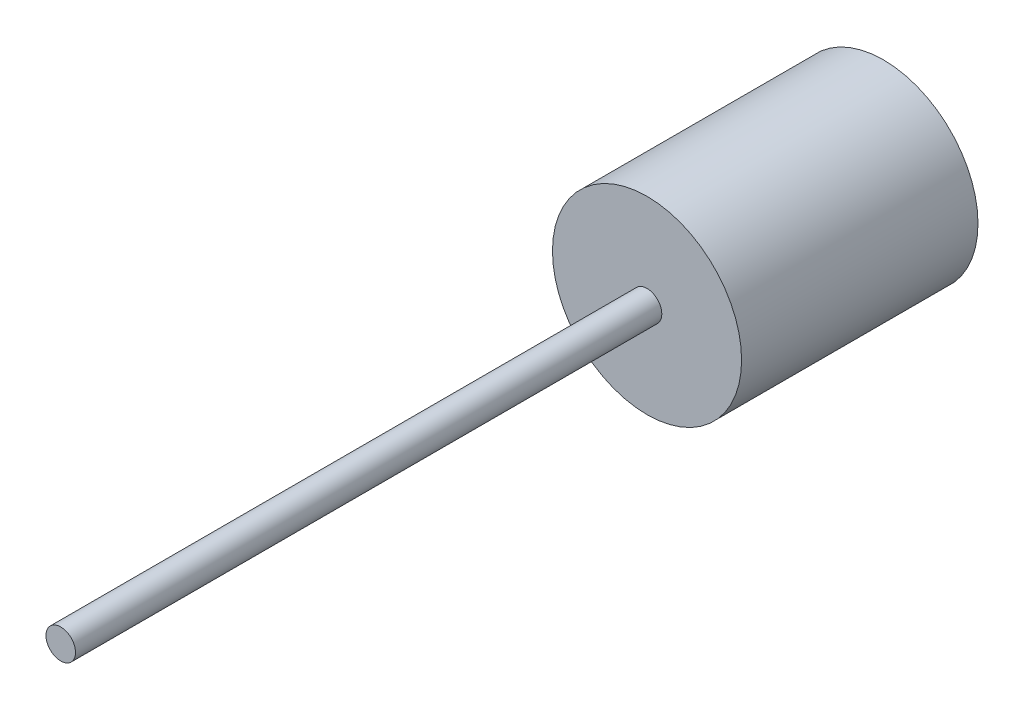
ISO-10303-21;
HEADER;
FILE_DESCRIPTION(('STEP AP214'),'2;1');
FILE_NAME('part.step','',(''),(''),'','','');
FILE_SCHEMA(('AUTOMOTIVE_DESIGN { 1 0 10303 214 1 1 1 1 }'));
ENDSEC;
DATA;
#1=APPLICATION_CONTEXT('core data for automotive mechanical design processes');
#2=APPLICATION_PROTOCOL_DEFINITION('international standard','automotive_design',2000,#1);
#3=PRODUCT_CONTEXT('',#1,'mechanical');
#4=PRODUCT('Part','Part','',(#3));
#5=PRODUCT_RELATED_PRODUCT_CATEGORY('part','',(#4));
#6=PRODUCT_DEFINITION_FORMATION('','',#4);
#7=PRODUCT_DEFINITION_CONTEXT('part definition',#1,'design');
#8=PRODUCT_DEFINITION('design','',#6,#7);
#9=PRODUCT_DEFINITION_SHAPE('','',#8);
#10=(LENGTH_UNIT() NAMED_UNIT(*) SI_UNIT(.MILLI.,.METRE.));
#11=(NAMED_UNIT(*) PLANE_ANGLE_UNIT() SI_UNIT($,.RADIAN.));
#12=(NAMED_UNIT(*) SI_UNIT($,.STERADIAN.) SOLID_ANGLE_UNIT());
#13=UNCERTAINTY_MEASURE_WITH_UNIT(LENGTH_MEASURE(1.E-05),#10,'distance_accuracy_value','');
#14=(GEOMETRIC_REPRESENTATION_CONTEXT(3) GLOBAL_UNCERTAINTY_ASSIGNED_CONTEXT((#13)) GLOBAL_UNIT_ASSIGNED_CONTEXT((#10,
#11,#12)) REPRESENTATION_CONTEXT('',''));
#15=CARTESIAN_POINT('',(0.,0.,0.));
#16=DIRECTION('',(0.,0.,1.));
#17=DIRECTION('',(1.,0.,0.));
#18=AXIS2_PLACEMENT_3D('',#15,#16,#17);
#19=CARTESIAN_POINT('',(0.,0.,31.75));
#20=DIRECTION('',(0.,0.,-1.));
#21=DIRECTION('',(-1.,0.,0.));
#22=AXIS2_PLACEMENT_3D('',#19,#20,#21);
#23=CYLINDRICAL_SURFACE('',#22,12.7);
#24=CARTESIAN_POINT('',(0.,0.,31.75));
#25=DIRECTION('',(0.,0.,1.));
#26=DIRECTION('',(1.,0.,0.));
#27=AXIS2_PLACEMENT_3D('',#24,#25,#26);
#28=CIRCLE('',#27,12.7);
#29=CARTESIAN_POINT('',(12.7,0.,31.75));
#30=VERTEX_POINT('',#29);
#31=EDGE_CURVE('E10',#30,#30,#28,.T.);
#32=ORIENTED_EDGE('',*,*,#31,.F.);
#33=EDGE_LOOP('',(#32));
#34=FACE_BOUND('',#33,.T.);
#35=CARTESIAN_POINT('',(0.,0.,0.));
#36=DIRECTION('',(0.,0.,1.));
#37=DIRECTION('',(1.,0.,0.));
#38=AXIS2_PLACEMENT_3D('',#35,#36,#37);
#39=CIRCLE('',#38,12.7);
#40=CARTESIAN_POINT('',(12.7,0.,0.));
#41=VERTEX_POINT('',#40);
#42=EDGE_CURVE('E35',#41,#41,#39,.T.);
#43=ORIENTED_EDGE('',*,*,#42,.T.);
#44=EDGE_LOOP('',(#43));
#45=FACE_BOUND('',#44,.T.);
#46=ADVANCED_FACE('F32',(#34,#45),#23,.T.);
#47=CARTESIAN_POINT('',(0.,0.,31.75));
#48=DIRECTION('',(0.,0.,1.));
#49=DIRECTION('',(1.,0.,0.));
#50=AXIS2_PLACEMENT_3D('',#47,#48,#49);
#51=PLANE('',#50);
#52=CARTESIAN_POINT('',(0.,0.,31.75));
#53=DIRECTION('',(0.,0.,1.));
#54=DIRECTION('',(1.,0.,0.));
#55=AXIS2_PLACEMENT_3D('',#52,#53,#54);
#56=CIRCLE('',#55,1.984375);
#57=CARTESIAN_POINT('',(1.984375,0.,31.75));
#58=VERTEX_POINT('',#57);
#59=EDGE_CURVE('E44',#58,#58,#56,.T.);
#60=ORIENTED_EDGE('',*,*,#59,.F.);
#61=EDGE_LOOP('',(#60));
#62=FACE_BOUND('',#61,.T.);
#63=ORIENTED_EDGE('',*,*,#31,.T.);
#64=EDGE_LOOP('',(#63));
#65=FACE_BOUND('',#64,.T.);
#66=ADVANCED_FACE('F59',(#62,#65),#51,.T.);
#67=CARTESIAN_POINT('',(0.,0.,0.));
#68=DIRECTION('',(0.,0.,1.));
#69=DIRECTION('',(1.,0.,0.));
#70=AXIS2_PLACEMENT_3D('',#67,#68,#69);
#71=PLANE('',#70);
#72=ORIENTED_EDGE('',*,*,#42,.F.);
#73=EDGE_LOOP('',(#72));
#74=FACE_BOUND('',#73,.T.);
#75=ADVANCED_FACE('F55',(#74),#71,.F.);
#76=CARTESIAN_POINT('',(0.,0.,110.49));
#77=DIRECTION('',(0.,0.,-1.));
#78=DIRECTION('',(-1.,0.,0.));
#79=AXIS2_PLACEMENT_3D('',#76,#77,#78);
#80=CYLINDRICAL_SURFACE('',#79,1.984375);
#81=CARTESIAN_POINT('',(0.,0.,110.49));
#82=DIRECTION('',(0.,0.,1.));
#83=DIRECTION('',(1.,0.,0.));
#84=AXIS2_PLACEMENT_3D('',#81,#82,#83);
#85=CIRCLE('',#84,1.984375);
#86=CARTESIAN_POINT('',(1.984375,0.,110.49));
#87=VERTEX_POINT('',#86);
#88=EDGE_CURVE('E42',#87,#87,#85,.T.);
#89=ORIENTED_EDGE('',*,*,#88,.F.);
#90=EDGE_LOOP('',(#89));
#91=FACE_BOUND('',#90,.T.);
#92=ORIENTED_EDGE('',*,*,#59,.T.);
#93=EDGE_LOOP('',(#92));
#94=FACE_BOUND('',#93,.T.);
#95=ADVANCED_FACE('F52',(#91,#94),#80,.T.);
#96=CARTESIAN_POINT('',(0.,0.,110.49));
#97=DIRECTION('',(0.,0.,1.));
#98=DIRECTION('',(1.,0.,0.));
#99=AXIS2_PLACEMENT_3D('',#96,#97,#98);
#100=PLANE('',#99);
#101=ORIENTED_EDGE('',*,*,#88,.T.);
#102=EDGE_LOOP('',(#101));
#103=FACE_BOUND('',#102,.T.);
#104=ADVANCED_FACE('F50',(#103),#100,.T.);
#105=CLOSED_SHELL('',(#46,#66,#75,#95,#104));
#106=MANIFOLD_SOLID_BREP('B2',#105);
#107=ADVANCED_BREP_SHAPE_REPRESENTATION('',(#18,#106),#14);
#108=SHAPE_DEFINITION_REPRESENTATION(#9,#107);
ENDSEC;
END-ISO-10303-21;
